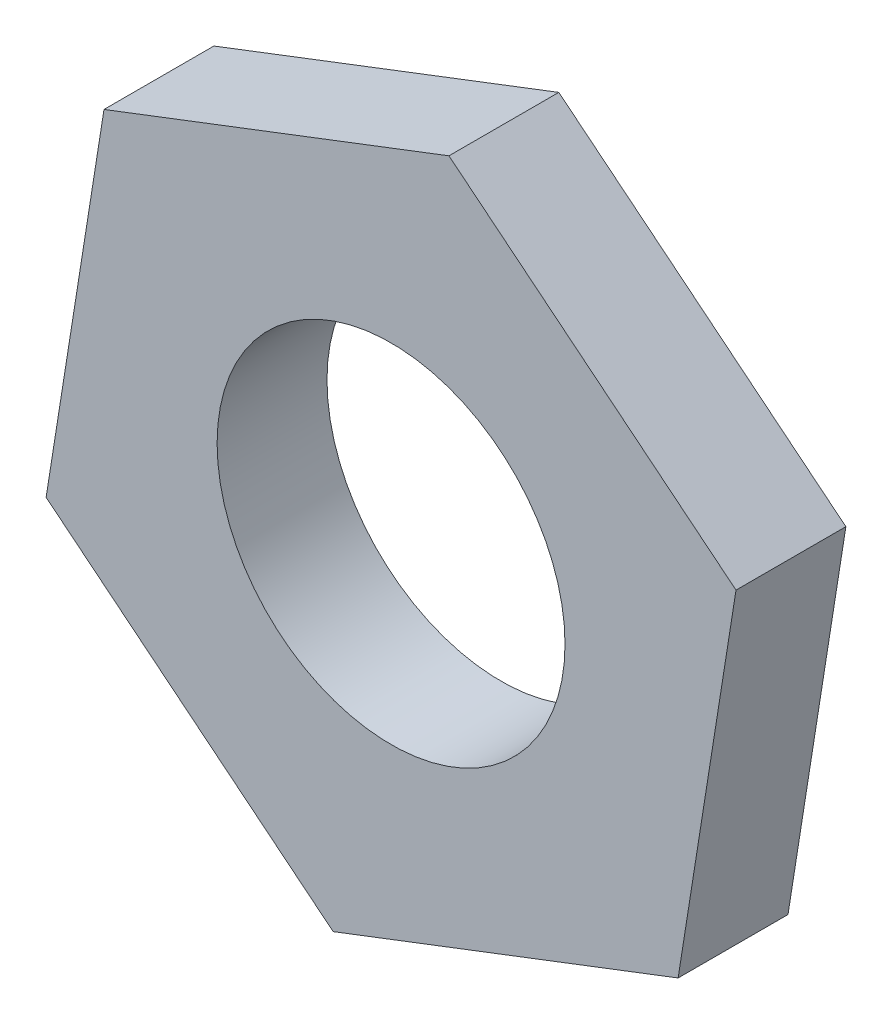
ISO-10303-21;
HEADER;
FILE_DESCRIPTION(('STEP AP214'),'2;1');
FILE_NAME('part.step','',(''),(''),'','','');
FILE_SCHEMA(('AUTOMOTIVE_DESIGN { 1 0 10303 214 1 1 1 1 }'));
ENDSEC;
DATA;
#1=APPLICATION_CONTEXT('core data for automotive mechanical design processes');
#2=APPLICATION_PROTOCOL_DEFINITION('international standard','automotive_design',2000,#1);
#3=PRODUCT_CONTEXT('',#1,'mechanical');
#4=PRODUCT('Part','Part','',(#3));
#5=PRODUCT_RELATED_PRODUCT_CATEGORY('part','',(#4));
#6=PRODUCT_DEFINITION_FORMATION('','',#4);
#7=PRODUCT_DEFINITION_CONTEXT('part definition',#1,'design');
#8=PRODUCT_DEFINITION('design','',#6,#7);
#9=PRODUCT_DEFINITION_SHAPE('','',#8);
#10=(LENGTH_UNIT() NAMED_UNIT(*) SI_UNIT(.MILLI.,.METRE.));
#11=(NAMED_UNIT(*) PLANE_ANGLE_UNIT() SI_UNIT($,.RADIAN.));
#12=(NAMED_UNIT(*) SI_UNIT($,.STERADIAN.) SOLID_ANGLE_UNIT());
#13=UNCERTAINTY_MEASURE_WITH_UNIT(LENGTH_MEASURE(1.E-05),#10,'distance_accuracy_value','');
#14=(GEOMETRIC_REPRESENTATION_CONTEXT(3) GLOBAL_UNCERTAINTY_ASSIGNED_CONTEXT((#13)) GLOBAL_UNIT_ASSIGNED_CONTEXT((#10,
#11,#12)) REPRESENTATION_CONTEXT('',''));
#15=CARTESIAN_POINT('',(0.,0.,0.));
#16=DIRECTION('',(0.,0.,1.));
#17=DIRECTION('',(1.,0.,0.));
#18=AXIS2_PLACEMENT_3D('',#15,#16,#17);
#19=CARTESIAN_POINT('',(0.,0.,3.));
#20=DIRECTION('',(0.,0.,1.));
#21=DIRECTION('',(1.,0.,0.));
#22=AXIS2_PLACEMENT_3D('',#19,#20,#21);
#23=PLANE('',#22);
#24=DIRECTION('',(0.93367243698871,0.35812816198613,0.));
#25=VECTOR('',#24,1.);
#26=CARTESIAN_POINT('',(-1.58060913229371,-9.96301143040954,3.));
#27=LINE('',#26,#25);
#28=CARTESIAN_POINT('',(-1.58060913229371,-9.96301143040954,3.));
#29=VERTEX_POINT('',#28);
#30=CARTESIAN_POINT('',(7.83791643078255,-6.3503533772248,3.));
#31=VERTEX_POINT('',#30);
#32=EDGE_CURVE('E133',#29,#31,#27,.T.);
#33=ORIENTED_EDGE('',*,*,#32,.T.);
#34=DIRECTION('',(0.156688132403737,0.987648130238613,0.));
#35=VECTOR('',#34,1.);
#36=CARTESIAN_POINT('',(7.83791643078255,-6.3503533772248,3.));
#37=LINE('',#36,#35);
#38=CARTESIAN_POINT('',(9.41852556307626,3.61265805318474,3.));
#39=VERTEX_POINT('',#38);
#40=EDGE_CURVE('E91',#31,#39,#37,.T.);
#41=ORIENTED_EDGE('',*,*,#40,.T.);
#42=DIRECTION('',(-0.776984304584972,0.629519968252483,0.));
#43=VECTOR('',#42,1.);
#44=CARTESIAN_POINT('',(9.41852556307626,3.61265805318474,3.));
#45=LINE('',#44,#43);
#46=CARTESIAN_POINT('',(1.58060913229371,9.96301143040954,3.));
#47=VERTEX_POINT('',#46);
#48=EDGE_CURVE('E104',#39,#47,#45,.T.);
#49=ORIENTED_EDGE('',*,*,#48,.T.);
#50=DIRECTION('',(-0.93367243698871,-0.35812816198613,0.));
#51=VECTOR('',#50,1.);
#52=CARTESIAN_POINT('',(1.58060913229371,9.96301143040954,3.));
#53=LINE('',#52,#51);
#54=CARTESIAN_POINT('',(-7.83791643078254,6.3503533772248,3.));
#55=VERTEX_POINT('',#54);
#56=EDGE_CURVE('E98',#47,#55,#53,.T.);
#57=ORIENTED_EDGE('',*,*,#56,.T.);
#58=DIRECTION('',(-0.156688132403738,-0.987648130238613,0.));
#59=VECTOR('',#58,1.);
#60=CARTESIAN_POINT('',(-7.83791643078254,6.3503533772248,3.));
#61=LINE('',#60,#59);
#62=CARTESIAN_POINT('',(-9.41852556307625,-3.61265805318474,3.));
#63=VERTEX_POINT('',#62);
#64=EDGE_CURVE('E102',#55,#63,#61,.T.);
#65=ORIENTED_EDGE('',*,*,#64,.T.);
#66=DIRECTION('',(0.776984304584972,-0.629519968252483,0.));
#67=VECTOR('',#66,1.);
#68=CARTESIAN_POINT('',(-9.41852556307625,-3.61265805318474,3.));
#69=LINE('',#68,#67);
#70=EDGE_CURVE('E54',#63,#29,#69,.T.);
#71=ORIENTED_EDGE('',*,*,#70,.T.);
#72=EDGE_LOOP('',(#33,#41,#49,#57,#65,#71));
#73=FACE_BOUND('',#72,.T.);
#74=CARTESIAN_POINT('',(0.,0.,3.));
#75=DIRECTION('',(0.,0.,1.));
#76=DIRECTION('',(1.,0.,0.));
#77=AXIS2_PLACEMENT_3D('',#74,#75,#76);
#78=CIRCLE('',#77,4.75);
#79=CARTESIAN_POINT('',(4.75,0.,3.));
#80=VERTEX_POINT('',#79);
#81=EDGE_CURVE('E126',#80,#80,#78,.T.);
#82=ORIENTED_EDGE('',*,*,#81,.F.);
#83=EDGE_LOOP('',(#82));
#84=FACE_BOUND('',#83,.T.);
#85=ADVANCED_FACE('F37',(#73,#84),#23,.T.);
#86=CARTESIAN_POINT('',(0.,0.,0.));
#87=DIRECTION('',(0.,0.,1.));
#88=DIRECTION('',(1.,0.,0.));
#89=AXIS2_PLACEMENT_3D('',#86,#87,#88);
#90=PLANE('',#89);
#91=DIRECTION('',(0.93367243698871,0.35812816198613,0.));
#92=VECTOR('',#91,1.);
#93=CARTESIAN_POINT('',(-1.58060913229371,-9.96301143040954,0.));
#94=LINE('',#93,#92);
#95=CARTESIAN_POINT('',(-1.58060913229371,-9.96301143040954,0.));
#96=VERTEX_POINT('',#95);
#97=CARTESIAN_POINT('',(7.83791643078255,-6.3503533772248,0.));
#98=VERTEX_POINT('',#97);
#99=EDGE_CURVE('E122',#96,#98,#94,.T.);
#100=ORIENTED_EDGE('',*,*,#99,.F.);
#101=DIRECTION('',(0.776984304584972,-0.629519968252483,0.));
#102=VECTOR('',#101,1.);
#103=CARTESIAN_POINT('',(-9.41852556307625,-3.61265805318474,0.));
#104=LINE('',#103,#102);
#105=CARTESIAN_POINT('',(-9.41852556307625,-3.61265805318474,0.));
#106=VERTEX_POINT('',#105);
#107=EDGE_CURVE('E83',#106,#96,#104,.T.);
#108=ORIENTED_EDGE('',*,*,#107,.F.);
#109=DIRECTION('',(-0.156688132403738,-0.987648130238613,0.));
#110=VECTOR('',#109,1.);
#111=CARTESIAN_POINT('',(-7.83791643078254,6.3503533772248,0.));
#112=LINE('',#111,#110);
#113=CARTESIAN_POINT('',(-7.83791643078254,6.3503533772248,0.));
#114=VERTEX_POINT('',#113);
#115=EDGE_CURVE('E77',#114,#106,#112,.T.);
#116=ORIENTED_EDGE('',*,*,#115,.F.);
#117=DIRECTION('',(-0.93367243698871,-0.35812816198613,0.));
#118=VECTOR('',#117,1.);
#119=CARTESIAN_POINT('',(1.58060913229371,9.96301143040954,0.));
#120=LINE('',#119,#118);
#121=CARTESIAN_POINT('',(1.58060913229371,9.96301143040954,0.));
#122=VERTEX_POINT('',#121);
#123=EDGE_CURVE('E112',#122,#114,#120,.T.);
#124=ORIENTED_EDGE('',*,*,#123,.F.);
#125=DIRECTION('',(-0.776984304584972,0.629519968252483,0.));
#126=VECTOR('',#125,1.);
#127=CARTESIAN_POINT('',(9.41852556307626,3.61265805318474,0.));
#128=LINE('',#127,#126);
#129=CARTESIAN_POINT('',(9.41852556307626,3.61265805318474,0.));
#130=VERTEX_POINT('',#129);
#131=EDGE_CURVE('E128',#130,#122,#128,.T.);
#132=ORIENTED_EDGE('',*,*,#131,.F.);
#133=DIRECTION('',(0.156688132403737,0.987648130238613,0.));
#134=VECTOR('',#133,1.);
#135=CARTESIAN_POINT('',(7.83791643078255,-6.3503533772248,0.));
#136=LINE('',#135,#134);
#137=EDGE_CURVE('E125',#98,#130,#136,.T.);
#138=ORIENTED_EDGE('',*,*,#137,.F.);
#139=EDGE_LOOP('',(#100,#108,#116,#124,#132,#138));
#140=FACE_BOUND('',#139,.T.);
#141=CARTESIAN_POINT('',(0.,0.,0.));
#142=DIRECTION('',(0.,0.,1.));
#143=DIRECTION('',(1.,0.,0.));
#144=AXIS2_PLACEMENT_3D('',#141,#142,#143);
#145=CIRCLE('',#144,4.75);
#146=CARTESIAN_POINT('',(4.75,0.,0.));
#147=VERTEX_POINT('',#146);
#148=EDGE_CURVE('E226',#147,#147,#145,.T.);
#149=ORIENTED_EDGE('',*,*,#148,.T.);
#150=EDGE_LOOP('',(#149));
#151=FACE_BOUND('',#150,.T.);
#152=ADVANCED_FACE('F142',(#140,#151),#90,.F.);
#153=CARTESIAN_POINT('',(-1.58060913229371,-9.96301143040954,3.));
#154=DIRECTION('',(-0.35812816198613,0.93367243698871,0.));
#155=DIRECTION('',(-0.93367243698871,-0.35812816198613,0.));
#156=AXIS2_PLACEMENT_3D('',#153,#154,#155);
#157=PLANE('',#156);
#158=ORIENTED_EDGE('',*,*,#99,.T.);
#159=DIRECTION('',(0.,0.,-1.));
#160=VECTOR('',#159,1.);
#161=CARTESIAN_POINT('',(7.83791643078255,-6.3503533772248,3.));
#162=LINE('',#161,#160);
#163=EDGE_CURVE('E11',#31,#98,#162,.T.);
#164=ORIENTED_EDGE('',*,*,#163,.F.);
#165=ORIENTED_EDGE('',*,*,#32,.F.);
#166=DIRECTION('',(0.,0.,-1.));
#167=VECTOR('',#166,1.);
#168=CARTESIAN_POINT('',(-1.58060913229371,-9.96301143040954,3.));
#169=LINE('',#168,#167);
#170=EDGE_CURVE('E118',#29,#96,#169,.T.);
#171=ORIENTED_EDGE('',*,*,#170,.T.);
#172=EDGE_LOOP('',(#158,#164,#165,#171));
#173=FACE_BOUND('',#172,.T.);
#174=ADVANCED_FACE('F39',(#173),#157,.F.);
#175=CARTESIAN_POINT('',(7.83791643078255,-6.3503533772248,3.));
#176=DIRECTION('',(-0.987648130238613,0.156688132403737,0.));
#177=DIRECTION('',(-0.156688132403737,-0.987648130238613,0.));
#178=AXIS2_PLACEMENT_3D('',#175,#176,#177);
#179=PLANE('',#178);
#180=ORIENTED_EDGE('',*,*,#137,.T.);
#181=DIRECTION('',(0.,0.,-1.));
#182=VECTOR('',#181,1.);
#183=CARTESIAN_POINT('',(9.41852556307626,3.61265805318474,3.));
#184=LINE('',#183,#182);
#185=EDGE_CURVE('E46',#39,#130,#184,.T.);
#186=ORIENTED_EDGE('',*,*,#185,.F.);
#187=ORIENTED_EDGE('',*,*,#40,.F.);
#188=ORIENTED_EDGE('',*,*,#163,.T.);
#189=EDGE_LOOP('',(#180,#186,#187,#188));
#190=FACE_BOUND('',#189,.T.);
#191=ADVANCED_FACE('F167',(#190),#179,.F.);
#192=CARTESIAN_POINT('',(9.41852556307626,3.61265805318474,3.));
#193=DIRECTION('',(-0.629519968252483,-0.776984304584972,0.));
#194=DIRECTION('',(0.776984304584972,-0.629519968252483,0.));
#195=AXIS2_PLACEMENT_3D('',#192,#193,#194);
#196=PLANE('',#195);
#197=ORIENTED_EDGE('',*,*,#131,.T.);
#198=DIRECTION('',(0.,0.,-1.));
#199=VECTOR('',#198,1.);
#200=CARTESIAN_POINT('',(1.58060913229371,9.96301143040954,3.));
#201=LINE('',#200,#199);
#202=EDGE_CURVE('E113',#47,#122,#201,.T.);
#203=ORIENTED_EDGE('',*,*,#202,.F.);
#204=ORIENTED_EDGE('',*,*,#48,.F.);
#205=ORIENTED_EDGE('',*,*,#185,.T.);
#206=EDGE_LOOP('',(#197,#203,#204,#205));
#207=FACE_BOUND('',#206,.T.);
#208=ADVANCED_FACE('F139',(#207),#196,.F.);
#209=CARTESIAN_POINT('',(1.58060913229371,9.96301143040954,3.));
#210=DIRECTION('',(0.35812816198613,-0.93367243698871,0.));
#211=DIRECTION('',(0.93367243698871,0.35812816198613,0.));
#212=AXIS2_PLACEMENT_3D('',#209,#210,#211);
#213=PLANE('',#212);
#214=ORIENTED_EDGE('',*,*,#123,.T.);
#215=DIRECTION('',(0.,0.,-1.));
#216=VECTOR('',#215,1.);
#217=CARTESIAN_POINT('',(-7.83791643078254,6.3503533772248,3.));
#218=LINE('',#217,#216);
#219=EDGE_CURVE('E109',#55,#114,#218,.T.);
#220=ORIENTED_EDGE('',*,*,#219,.F.);
#221=ORIENTED_EDGE('',*,*,#56,.F.);
#222=ORIENTED_EDGE('',*,*,#202,.T.);
#223=EDGE_LOOP('',(#214,#220,#221,#222));
#224=FACE_BOUND('',#223,.T.);
#225=ADVANCED_FACE('F110',(#224),#213,.F.);
#226=CARTESIAN_POINT('',(-7.83791643078254,6.3503533772248,3.));
#227=DIRECTION('',(0.987648130238613,-0.156688132403738,0.));
#228=DIRECTION('',(0.156688132403738,0.987648130238613,0.));
#229=AXIS2_PLACEMENT_3D('',#226,#227,#228);
#230=PLANE('',#229);
#231=ORIENTED_EDGE('',*,*,#115,.T.);
#232=DIRECTION('',(0.,0.,-1.));
#233=VECTOR('',#232,1.);
#234=CARTESIAN_POINT('',(-9.41852556307625,-3.61265805318474,3.));
#235=LINE('',#234,#233);
#236=EDGE_CURVE('E114',#63,#106,#235,.T.);
#237=ORIENTED_EDGE('',*,*,#236,.F.);
#238=ORIENTED_EDGE('',*,*,#64,.F.);
#239=ORIENTED_EDGE('',*,*,#219,.T.);
#240=EDGE_LOOP('',(#231,#237,#238,#239));
#241=FACE_BOUND('',#240,.T.);
#242=ADVANCED_FACE('F116',(#241),#230,.F.);
#243=CARTESIAN_POINT('',(-9.41852556307625,-3.61265805318474,3.));
#244=DIRECTION('',(0.629519968252483,0.776984304584972,0.));
#245=DIRECTION('',(-0.776984304584972,0.629519968252483,0.));
#246=AXIS2_PLACEMENT_3D('',#243,#244,#245);
#247=PLANE('',#246);
#248=ORIENTED_EDGE('',*,*,#107,.T.);
#249=ORIENTED_EDGE('',*,*,#170,.F.);
#250=ORIENTED_EDGE('',*,*,#70,.F.);
#251=ORIENTED_EDGE('',*,*,#236,.T.);
#252=EDGE_LOOP('',(#248,#249,#250,#251));
#253=FACE_BOUND('',#252,.T.);
#254=ADVANCED_FACE('F147',(#253),#247,.F.);
#255=CARTESIAN_POINT('',(0.,0.,3.));
#256=DIRECTION('',(0.,0.,-1.));
#257=DIRECTION('',(-1.,0.,0.));
#258=AXIS2_PLACEMENT_3D('',#255,#256,#257);
#259=CYLINDRICAL_SURFACE('',#258,4.75);
#260=ORIENTED_EDGE('',*,*,#81,.T.);
#261=EDGE_LOOP('',(#260));
#262=FACE_BOUND('',#261,.T.);
#263=ORIENTED_EDGE('',*,*,#148,.F.);
#264=EDGE_LOOP('',(#263));
#265=FACE_BOUND('',#264,.T.);
#266=ADVANCED_FACE('F149',(#262,#265),#259,.F.);
#267=CLOSED_SHELL('',(#85,#152,#174,#191,#208,#225,#242,#254,#266));
#268=MANIFOLD_SOLID_BREP('B2',#267);
#269=ADVANCED_BREP_SHAPE_REPRESENTATION('',(#18,#268),#14);
#270=SHAPE_DEFINITION_REPRESENTATION(#9,#269);
ENDSEC;
END-ISO-10303-21;
